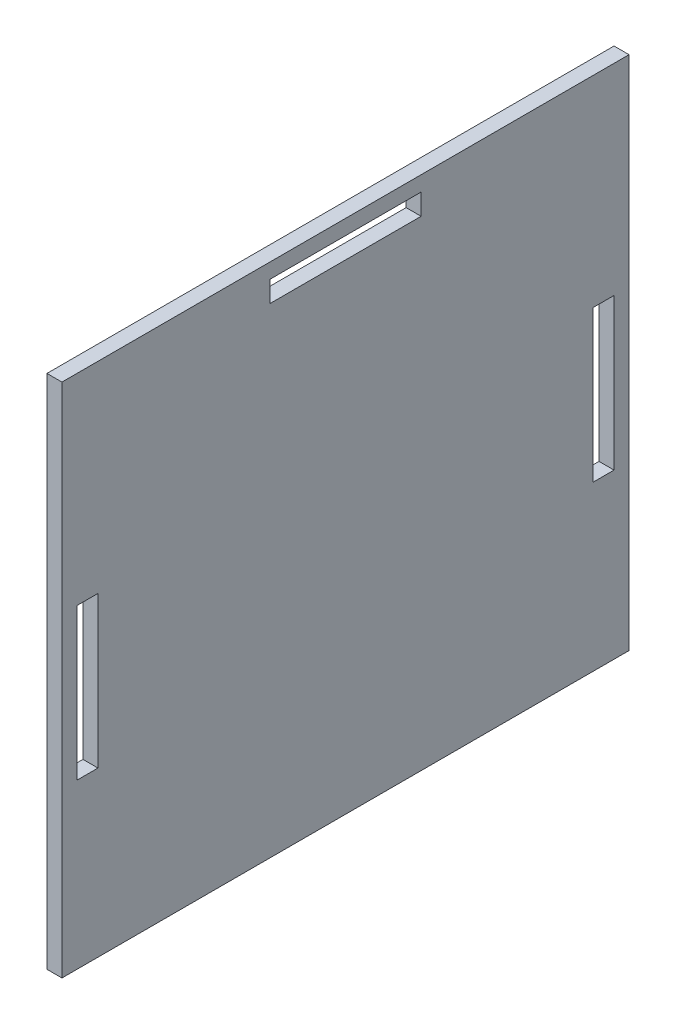
ISO-10303-21;
HEADER;
FILE_DESCRIPTION(('STEP AP214'),'2;1');
FILE_NAME('part.step','',(''),(''),'','','');
FILE_SCHEMA(('AUTOMOTIVE_DESIGN { 1 0 10303 214 1 1 1 1 }'));
ENDSEC;
DATA;
#1=APPLICATION_CONTEXT('core data for automotive mechanical design processes');
#2=APPLICATION_PROTOCOL_DEFINITION('international standard','automotive_design',2000,#1);
#3=PRODUCT_CONTEXT('',#1,'mechanical');
#4=PRODUCT('Part','Part','',(#3));
#5=PRODUCT_RELATED_PRODUCT_CATEGORY('part','',(#4));
#6=PRODUCT_DEFINITION_FORMATION('','',#4);
#7=PRODUCT_DEFINITION_CONTEXT('part definition',#1,'design');
#8=PRODUCT_DEFINITION('design','',#6,#7);
#9=PRODUCT_DEFINITION_SHAPE('','',#8);
#10=(LENGTH_UNIT() NAMED_UNIT(*) SI_UNIT(.MILLI.,.METRE.));
#11=(NAMED_UNIT(*) PLANE_ANGLE_UNIT() SI_UNIT($,.RADIAN.));
#12=(NAMED_UNIT(*) SI_UNIT($,.STERADIAN.) SOLID_ANGLE_UNIT());
#13=UNCERTAINTY_MEASURE_WITH_UNIT(LENGTH_MEASURE(1.E-05),#10,'distance_accuracy_value','');
#14=(GEOMETRIC_REPRESENTATION_CONTEXT(3) GLOBAL_UNCERTAINTY_ASSIGNED_CONTEXT((#13)) GLOBAL_UNIT_ASSIGNED_CONTEXT((#10,
#11,#12)) REPRESENTATION_CONTEXT('',''));
#15=CARTESIAN_POINT('',(0.,0.,0.));
#16=DIRECTION('',(0.,0.,1.));
#17=DIRECTION('',(1.,0.,0.));
#18=AXIS2_PLACEMENT_3D('',#15,#16,#17);
#19=CARTESIAN_POINT('',(5.,0.,0.));
#20=DIRECTION('',(-1.,0.,0.));
#21=DIRECTION('',(0.,0.,1.));
#22=AXIS2_PLACEMENT_3D('',#19,#20,#21);
#23=PLANE('',#22);
#24=DIRECTION('',(0.,1.,0.));
#25=VECTOR('',#24,1.);
#26=CARTESIAN_POINT('',(5.,54.6,12.));
#27=LINE('',#26,#25);
#28=CARTESIAN_POINT('',(5.,54.6,12.));
#29=VERTEX_POINT('',#28);
#30=CARTESIAN_POINT('',(5.,105.,12.));
#31=VERTEX_POINT('',#30);
#32=EDGE_CURVE('E241',#29,#31,#27,.T.);
#33=ORIENTED_EDGE('',*,*,#32,.T.);
#34=DIRECTION('',(0.,0.,-1.));
#35=VECTOR('',#34,1.);
#36=CARTESIAN_POINT('',(5.,105.,12.));
#37=LINE('',#36,#35);
#38=CARTESIAN_POINT('',(5.,105.,4.99999999999999));
#39=VERTEX_POINT('',#38);
#40=EDGE_CURVE('E235',#31,#39,#37,.T.);
#41=ORIENTED_EDGE('',*,*,#40,.T.);
#42=DIRECTION('',(0.,1.,0.));
#43=VECTOR('',#42,1.);
#44=CARTESIAN_POINT('',(5.,54.6,5.));
#45=LINE('',#44,#43);
#46=CARTESIAN_POINT('',(5.,54.6,5.));
#47=VERTEX_POINT('',#46);
#48=EDGE_CURVE('E226',#47,#39,#45,.T.);
#49=ORIENTED_EDGE('',*,*,#48,.F.);
#50=DIRECTION('',(0.,0.,-1.));
#51=VECTOR('',#50,1.);
#52=CARTESIAN_POINT('',(5.,54.6,12.));
#53=LINE('',#52,#51);
#54=EDGE_CURVE('E234',#29,#47,#53,.T.);
#55=ORIENTED_EDGE('',*,*,#54,.F.);
#56=EDGE_LOOP('',(#33,#41,#49,#55));
#57=FACE_BOUND('',#56,.T.);
#58=DIRECTION('',(0.,1.,0.));
#59=VECTOR('',#58,1.);
#60=CARTESIAN_POINT('',(5.,54.6,177.));
#61=LINE('',#60,#59);
#62=CARTESIAN_POINT('',(5.,54.6,177.));
#63=VERTEX_POINT('',#62);
#64=CARTESIAN_POINT('',(5.,105.,177.));
#65=VERTEX_POINT('',#64);
#66=EDGE_CURVE('E317',#63,#65,#61,.T.);
#67=ORIENTED_EDGE('',*,*,#66,.F.);
#68=DIRECTION('',(0.,0.,1.));
#69=VECTOR('',#68,1.);
#70=CARTESIAN_POINT('',(5.,54.6,177.));
#71=LINE('',#70,#69);
#72=CARTESIAN_POINT('',(5.,54.6,184.));
#73=VERTEX_POINT('',#72);
#74=EDGE_CURVE('E328',#63,#73,#71,.T.);
#75=ORIENTED_EDGE('',*,*,#74,.T.);
#76=DIRECTION('',(0.,1.,0.));
#77=VECTOR('',#76,1.);
#78=CARTESIAN_POINT('',(5.,54.6,184.));
#79=LINE('',#78,#77);
#80=CARTESIAN_POINT('',(5.,105.,184.));
#81=VERTEX_POINT('',#80);
#82=EDGE_CURVE('E324',#73,#81,#79,.T.);
#83=ORIENTED_EDGE('',*,*,#82,.T.);
#84=DIRECTION('',(0.,0.,1.));
#85=VECTOR('',#84,1.);
#86=CARTESIAN_POINT('',(5.,105.,177.));
#87=LINE('',#86,#85);
#88=EDGE_CURVE('E320',#65,#81,#87,.T.);
#89=ORIENTED_EDGE('',*,*,#88,.F.);
#90=EDGE_LOOP('',(#67,#75,#83,#89));
#91=FACE_BOUND('',#90,.T.);
#92=DIRECTION('',(0.,0.,1.));
#93=VECTOR('',#92,1.);
#94=CARTESIAN_POINT('',(5.,172.,0.));
#95=LINE('',#94,#93);
#96=CARTESIAN_POINT('',(5.,172.,0.));
#97=VERTEX_POINT('',#96);
#98=CARTESIAN_POINT('',(5.,172.,189.));
#99=VERTEX_POINT('',#98);
#100=EDGE_CURVE('E361',#97,#99,#95,.T.);
#101=ORIENTED_EDGE('',*,*,#100,.T.);
#102=DIRECTION('',(0.,1.,0.));
#103=VECTOR('',#102,1.);
#104=CARTESIAN_POINT('',(5.,0.,189.));
#105=LINE('',#104,#103);
#106=CARTESIAN_POINT('',(5.,0.,189.));
#107=VERTEX_POINT('',#106);
#108=EDGE_CURVE('E364',#107,#99,#105,.T.);
#109=ORIENTED_EDGE('',*,*,#108,.F.);
#110=DIRECTION('',(0.,0.,1.));
#111=VECTOR('',#110,1.);
#112=CARTESIAN_POINT('',(5.,0.,0.));
#113=LINE('',#112,#111);
#114=CARTESIAN_POINT('',(5.,0.,0.));
#115=VERTEX_POINT('',#114);
#116=EDGE_CURVE('E369',#115,#107,#113,.T.);
#117=ORIENTED_EDGE('',*,*,#116,.F.);
#118=DIRECTION('',(0.,1.,0.));
#119=VECTOR('',#118,1.);
#120=CARTESIAN_POINT('',(5.,0.,0.));
#121=LINE('',#120,#119);
#122=EDGE_CURVE('E373',#115,#97,#121,.T.);
#123=ORIENTED_EDGE('',*,*,#122,.T.);
#124=EDGE_LOOP('',(#101,#109,#117,#123));
#125=FACE_BOUND('',#124,.T.);
#126=DIRECTION('',(0.,0.,-1.));
#127=VECTOR('',#126,1.);
#128=CARTESIAN_POINT('',(5.,160.,119.7));
#129=LINE('',#128,#127);
#130=CARTESIAN_POINT('',(5.,160.,119.7));
#131=VERTEX_POINT('',#130);
#132=CARTESIAN_POINT('',(5.,160.,69.3));
#133=VERTEX_POINT('',#132);
#134=EDGE_CURVE('E274',#131,#133,#129,.T.);
#135=ORIENTED_EDGE('',*,*,#134,.F.);
#136=DIRECTION('',(0.,-1.,0.));
#137=VECTOR('',#136,1.);
#138=CARTESIAN_POINT('',(5.,167.,119.7));
#139=LINE('',#138,#137);
#140=CARTESIAN_POINT('',(5.,167.,119.7));
#141=VERTEX_POINT('',#140);
#142=EDGE_CURVE('E286',#141,#131,#139,.T.);
#143=ORIENTED_EDGE('',*,*,#142,.F.);
#144=DIRECTION('',(0.,0.,-1.));
#145=VECTOR('',#144,1.);
#146=CARTESIAN_POINT('',(5.,167.,119.7));
#147=LINE('',#146,#145);
#148=CARTESIAN_POINT('',(5.,167.,69.3));
#149=VERTEX_POINT('',#148);
#150=EDGE_CURVE('E282',#141,#149,#147,.T.);
#151=ORIENTED_EDGE('',*,*,#150,.T.);
#152=DIRECTION('',(0.,-1.,0.));
#153=VECTOR('',#152,1.);
#154=CARTESIAN_POINT('',(5.,167.,69.3));
#155=LINE('',#154,#153);
#156=EDGE_CURVE('E277',#149,#133,#155,.T.);
#157=ORIENTED_EDGE('',*,*,#156,.T.);
#158=EDGE_LOOP('',(#135,#143,#151,#157));
#159=FACE_BOUND('',#158,.T.);
#160=ADVANCED_FACE('F114',(#57,#91,#125,#159),#23,.F.);
#161=CARTESIAN_POINT('',(0.,0.,0.));
#162=DIRECTION('',(-1.,0.,0.));
#163=DIRECTION('',(0.,0.,1.));
#164=AXIS2_PLACEMENT_3D('',#161,#162,#163);
#165=PLANE('',#164);
#166=DIRECTION('',(0.,0.,-1.));
#167=VECTOR('',#166,1.);
#168=CARTESIAN_POINT('',(0.,105.,12.));
#169=LINE('',#168,#167);
#170=CARTESIAN_POINT('',(0.,105.,12.));
#171=VERTEX_POINT('',#170);
#172=CARTESIAN_POINT('',(0.,105.,4.99999999999999));
#173=VERTEX_POINT('',#172);
#174=EDGE_CURVE('E138',#171,#173,#169,.T.);
#175=ORIENTED_EDGE('',*,*,#174,.F.);
#176=DIRECTION('',(0.,1.,0.));
#177=VECTOR('',#176,1.);
#178=CARTESIAN_POINT('',(0.,54.6,12.));
#179=LINE('',#178,#177);
#180=CARTESIAN_POINT('',(0.,54.6,12.));
#181=VERTEX_POINT('',#180);
#182=EDGE_CURVE('E246',#181,#171,#179,.T.);
#183=ORIENTED_EDGE('',*,*,#182,.F.);
#184=DIRECTION('',(0.,0.,-1.));
#185=VECTOR('',#184,1.);
#186=CARTESIAN_POINT('',(0.,54.6,12.));
#187=LINE('',#186,#185);
#188=CARTESIAN_POINT('',(0.,54.6,5.));
#189=VERTEX_POINT('',#188);
#190=EDGE_CURVE('E250',#181,#189,#187,.T.);
#191=ORIENTED_EDGE('',*,*,#190,.T.);
#192=DIRECTION('',(0.,1.,0.));
#193=VECTOR('',#192,1.);
#194=CARTESIAN_POINT('',(0.,54.6,5.));
#195=LINE('',#194,#193);
#196=EDGE_CURVE('E259',#189,#173,#195,.T.);
#197=ORIENTED_EDGE('',*,*,#196,.T.);
#198=EDGE_LOOP('',(#175,#183,#191,#197));
#199=FACE_BOUND('',#198,.T.);
#200=DIRECTION('',(0.,0.,1.));
#201=VECTOR('',#200,1.);
#202=CARTESIAN_POINT('',(0.,172.,0.));
#203=LINE('',#202,#201);
#204=CARTESIAN_POINT('',(0.,172.,0.));
#205=VERTEX_POINT('',#204);
#206=CARTESIAN_POINT('',(0.,172.,189.));
#207=VERTEX_POINT('',#206);
#208=EDGE_CURVE('E360',#205,#207,#203,.T.);
#209=ORIENTED_EDGE('',*,*,#208,.F.);
#210=DIRECTION('',(0.,1.,0.));
#211=VECTOR('',#210,1.);
#212=CARTESIAN_POINT('',(0.,0.,0.));
#213=LINE('',#212,#211);
#214=CARTESIAN_POINT('',(0.,0.,0.));
#215=VERTEX_POINT('',#214);
#216=EDGE_CURVE('E365',#215,#205,#213,.T.);
#217=ORIENTED_EDGE('',*,*,#216,.F.);
#218=DIRECTION('',(0.,0.,1.));
#219=VECTOR('',#218,1.);
#220=CARTESIAN_POINT('',(0.,0.,0.));
#221=LINE('',#220,#219);
#222=CARTESIAN_POINT('',(0.,0.,189.));
#223=VERTEX_POINT('',#222);
#224=EDGE_CURVE('E384',#215,#223,#221,.T.);
#225=ORIENTED_EDGE('',*,*,#224,.T.);
#226=DIRECTION('',(0.,1.,0.));
#227=VECTOR('',#226,1.);
#228=CARTESIAN_POINT('',(0.,0.,189.));
#229=LINE('',#228,#227);
#230=EDGE_CURVE('E380',#223,#207,#229,.T.);
#231=ORIENTED_EDGE('',*,*,#230,.T.);
#232=EDGE_LOOP('',(#209,#217,#225,#231));
#233=FACE_BOUND('',#232,.T.);
#234=DIRECTION('',(0.,0.,1.));
#235=VECTOR('',#234,1.);
#236=CARTESIAN_POINT('',(0.,54.6,177.));
#237=LINE('',#236,#235);
#238=CARTESIAN_POINT('',(0.,54.6,177.));
#239=VERTEX_POINT('',#238);
#240=CARTESIAN_POINT('',(0.,54.6,184.));
#241=VERTEX_POINT('',#240);
#242=EDGE_CURVE('E321',#239,#241,#237,.T.);
#243=ORIENTED_EDGE('',*,*,#242,.F.);
#244=DIRECTION('',(0.,1.,0.));
#245=VECTOR('',#244,1.);
#246=CARTESIAN_POINT('',(0.,54.6,177.));
#247=LINE('',#246,#245);
#248=CARTESIAN_POINT('',(0.,105.,177.));
#249=VERTEX_POINT('',#248);
#250=EDGE_CURVE('E316',#239,#249,#247,.T.);
#251=ORIENTED_EDGE('',*,*,#250,.T.);
#252=DIRECTION('',(0.,0.,1.));
#253=VECTOR('',#252,1.);
#254=CARTESIAN_POINT('',(0.,105.,177.));
#255=LINE('',#254,#253);
#256=CARTESIAN_POINT('',(0.,105.,184.));
#257=VERTEX_POINT('',#256);
#258=EDGE_CURVE('E336',#249,#257,#255,.T.);
#259=ORIENTED_EDGE('',*,*,#258,.T.);
#260=DIRECTION('',(0.,1.,0.));
#261=VECTOR('',#260,1.);
#262=CARTESIAN_POINT('',(0.,54.6,184.));
#263=LINE('',#262,#261);
#264=EDGE_CURVE('E340',#241,#257,#263,.T.);
#265=ORIENTED_EDGE('',*,*,#264,.F.);
#266=EDGE_LOOP('',(#243,#251,#259,#265));
#267=FACE_BOUND('',#266,.T.);
#268=DIRECTION('',(0.,-1.,0.));
#269=VECTOR('',#268,1.);
#270=CARTESIAN_POINT('',(0.,167.,119.7));
#271=LINE('',#270,#269);
#272=CARTESIAN_POINT('',(0.,167.,119.7));
#273=VERTEX_POINT('',#272);
#274=CARTESIAN_POINT('',(0.,160.,119.7));
#275=VERTEX_POINT('',#274);
#276=EDGE_CURVE('E278',#273,#275,#271,.T.);
#277=ORIENTED_EDGE('',*,*,#276,.T.);
#278=DIRECTION('',(0.,0.,-1.));
#279=VECTOR('',#278,1.);
#280=CARTESIAN_POINT('',(0.,160.,119.7));
#281=LINE('',#280,#279);
#282=CARTESIAN_POINT('',(0.,160.,69.3));
#283=VERTEX_POINT('',#282);
#284=EDGE_CURVE('E268',#275,#283,#281,.T.);
#285=ORIENTED_EDGE('',*,*,#284,.T.);
#286=DIRECTION('',(0.,-1.,0.));
#287=VECTOR('',#286,1.);
#288=CARTESIAN_POINT('',(0.,167.,69.3));
#289=LINE('',#288,#287);
#290=CARTESIAN_POINT('',(0.,167.,69.3));
#291=VERTEX_POINT('',#290);
#292=EDGE_CURVE('E293',#291,#283,#289,.T.);
#293=ORIENTED_EDGE('',*,*,#292,.F.);
#294=DIRECTION('',(0.,0.,-1.));
#295=VECTOR('',#294,1.);
#296=CARTESIAN_POINT('',(0.,167.,119.7));
#297=LINE('',#296,#295);
#298=EDGE_CURVE('E297',#273,#291,#297,.T.);
#299=ORIENTED_EDGE('',*,*,#298,.F.);
#300=EDGE_LOOP('',(#277,#285,#293,#299));
#301=FACE_BOUND('',#300,.T.);
#302=ADVANCED_FACE('F408',(#199,#233,#267,#301),#165,.T.);
#303=CARTESIAN_POINT('',(5.,172.,0.));
#304=DIRECTION('',(0.,-1.,0.));
#305=DIRECTION('',(0.,0.,-1.));
#306=AXIS2_PLACEMENT_3D('',#303,#304,#305);
#307=PLANE('',#306);
#308=ORIENTED_EDGE('',*,*,#208,.T.);
#309=DIRECTION('',(-1.,0.,0.));
#310=VECTOR('',#309,1.);
#311=CARTESIAN_POINT('',(5.,172.,189.));
#312=LINE('',#311,#310);
#313=EDGE_CURVE('E12',#99,#207,#312,.T.);
#314=ORIENTED_EDGE('',*,*,#313,.F.);
#315=ORIENTED_EDGE('',*,*,#100,.F.);
#316=DIRECTION('',(-1.,0.,0.));
#317=VECTOR('',#316,1.);
#318=CARTESIAN_POINT('',(5.,172.,0.));
#319=LINE('',#318,#317);
#320=EDGE_CURVE('E376',#97,#205,#319,.T.);
#321=ORIENTED_EDGE('',*,*,#320,.T.);
#322=EDGE_LOOP('',(#308,#314,#315,#321));
#323=FACE_BOUND('',#322,.T.);
#324=ADVANCED_FACE('F116',(#323),#307,.F.);
#325=CARTESIAN_POINT('',(5.,0.,189.));
#326=DIRECTION('',(0.,0.,1.));
#327=DIRECTION('',(1.,0.,0.));
#328=AXIS2_PLACEMENT_3D('',#325,#326,#327);
#329=PLANE('',#328);
#330=ORIENTED_EDGE('',*,*,#230,.F.);
#331=DIRECTION('',(-1.,0.,0.));
#332=VECTOR('',#331,1.);
#333=CARTESIAN_POINT('',(5.,0.,189.));
#334=LINE('',#333,#332);
#335=EDGE_CURVE('E123',#107,#223,#334,.T.);
#336=ORIENTED_EDGE('',*,*,#335,.F.);
#337=ORIENTED_EDGE('',*,*,#108,.T.);
#338=ORIENTED_EDGE('',*,*,#313,.T.);
#339=EDGE_LOOP('',(#330,#336,#337,#338));
#340=FACE_BOUND('',#339,.T.);
#341=ADVANCED_FACE('F403',(#340),#329,.T.);
#342=CARTESIAN_POINT('',(5.,0.,0.));
#343=DIRECTION('',(0.,-1.,0.));
#344=DIRECTION('',(0.,0.,-1.));
#345=AXIS2_PLACEMENT_3D('',#342,#343,#344);
#346=PLANE('',#345);
#347=ORIENTED_EDGE('',*,*,#224,.F.);
#348=DIRECTION('',(-1.,0.,0.));
#349=VECTOR('',#348,1.);
#350=CARTESIAN_POINT('',(5.,0.,0.));
#351=LINE('',#350,#349);
#352=EDGE_CURVE('E393',#115,#215,#351,.T.);
#353=ORIENTED_EDGE('',*,*,#352,.F.);
#354=ORIENTED_EDGE('',*,*,#116,.T.);
#355=ORIENTED_EDGE('',*,*,#335,.T.);
#356=EDGE_LOOP('',(#347,#353,#354,#355));
#357=FACE_BOUND('',#356,.T.);
#358=ADVANCED_FACE('F399',(#357),#346,.T.);
#359=CARTESIAN_POINT('',(5.,0.,0.));
#360=DIRECTION('',(0.,0.,1.));
#361=DIRECTION('',(0.,-1.,0.));
#362=AXIS2_PLACEMENT_3D('',#359,#360,#361);
#363=PLANE('',#362);
#364=ORIENTED_EDGE('',*,*,#216,.T.);
#365=ORIENTED_EDGE('',*,*,#320,.F.);
#366=ORIENTED_EDGE('',*,*,#122,.F.);
#367=ORIENTED_EDGE('',*,*,#352,.T.);
#368=EDGE_LOOP('',(#364,#365,#366,#367));
#369=FACE_BOUND('',#368,.T.);
#370=ADVANCED_FACE('F412',(#369),#363,.F.);
#371=CARTESIAN_POINT('',(5.,54.6,177.));
#372=DIRECTION('',(0.,0.,1.));
#373=DIRECTION('',(1.,0.,0.));
#374=AXIS2_PLACEMENT_3D('',#371,#372,#373);
#375=PLANE('',#374);
#376=ORIENTED_EDGE('',*,*,#250,.F.);
#377=DIRECTION('',(-1.,0.,0.));
#378=VECTOR('',#377,1.);
#379=CARTESIAN_POINT('',(5.,54.6,177.));
#380=LINE('',#379,#378);
#381=EDGE_CURVE('E332',#63,#239,#380,.T.);
#382=ORIENTED_EDGE('',*,*,#381,.F.);
#383=ORIENTED_EDGE('',*,*,#66,.T.);
#384=DIRECTION('',(-1.,0.,0.));
#385=VECTOR('',#384,1.);
#386=CARTESIAN_POINT('',(5.,105.,177.));
#387=LINE('',#386,#385);
#388=EDGE_CURVE('E356',#65,#249,#387,.T.);
#389=ORIENTED_EDGE('',*,*,#388,.T.);
#390=EDGE_LOOP('',(#376,#382,#383,#389));
#391=FACE_BOUND('',#390,.T.);
#392=ADVANCED_FACE('F461',(#391),#375,.T.);
#393=CARTESIAN_POINT('',(5.,105.,177.));
#394=DIRECTION('',(0.,-1.,0.));
#395=DIRECTION('',(0.,0.,-1.));
#396=AXIS2_PLACEMENT_3D('',#393,#394,#395);
#397=PLANE('',#396);
#398=ORIENTED_EDGE('',*,*,#258,.F.);
#399=ORIENTED_EDGE('',*,*,#388,.F.);
#400=ORIENTED_EDGE('',*,*,#88,.T.);
#401=DIRECTION('',(-1.,0.,0.));
#402=VECTOR('',#401,1.);
#403=CARTESIAN_POINT('',(5.,105.,184.));
#404=LINE('',#403,#402);
#405=EDGE_CURVE('E353',#81,#257,#404,.T.);
#406=ORIENTED_EDGE('',*,*,#405,.T.);
#407=EDGE_LOOP('',(#398,#399,#400,#406));
#408=FACE_BOUND('',#407,.T.);
#409=ADVANCED_FACE('F457',(#408),#397,.T.);
#410=CARTESIAN_POINT('',(5.,54.6,184.));
#411=DIRECTION('',(0.,0.,1.));
#412=DIRECTION('',(1.,0.,0.));
#413=AXIS2_PLACEMENT_3D('',#410,#411,#412);
#414=PLANE('',#413);
#415=ORIENTED_EDGE('',*,*,#264,.T.);
#416=ORIENTED_EDGE('',*,*,#405,.F.);
#417=ORIENTED_EDGE('',*,*,#82,.F.);
#418=DIRECTION('',(-1.,0.,0.));
#419=VECTOR('',#418,1.);
#420=CARTESIAN_POINT('',(5.,54.6,184.));
#421=LINE('',#420,#419);
#422=EDGE_CURVE('E350',#73,#241,#421,.T.);
#423=ORIENTED_EDGE('',*,*,#422,.T.);
#424=EDGE_LOOP('',(#415,#416,#417,#423));
#425=FACE_BOUND('',#424,.T.);
#426=ADVANCED_FACE('F453',(#425),#414,.F.);
#427=CARTESIAN_POINT('',(5.,54.6,177.));
#428=DIRECTION('',(0.,-1.,0.));
#429=DIRECTION('',(0.,0.,-1.));
#430=AXIS2_PLACEMENT_3D('',#427,#428,#429);
#431=PLANE('',#430);
#432=ORIENTED_EDGE('',*,*,#242,.T.);
#433=ORIENTED_EDGE('',*,*,#422,.F.);
#434=ORIENTED_EDGE('',*,*,#74,.F.);
#435=ORIENTED_EDGE('',*,*,#381,.T.);
#436=EDGE_LOOP('',(#432,#433,#434,#435));
#437=FACE_BOUND('',#436,.T.);
#438=ADVANCED_FACE('F450',(#437),#431,.F.);
#439=CARTESIAN_POINT('',(5.,160.,119.7));
#440=DIRECTION('',(0.,1.,0.));
#441=DIRECTION('',(0.,0.,1.));
#442=AXIS2_PLACEMENT_3D('',#439,#440,#441);
#443=PLANE('',#442);
#444=ORIENTED_EDGE('',*,*,#284,.F.);
#445=DIRECTION('',(-1.,0.,0.));
#446=VECTOR('',#445,1.);
#447=CARTESIAN_POINT('',(5.,160.,119.7));
#448=LINE('',#447,#446);
#449=EDGE_CURVE('E289',#131,#275,#448,.T.);
#450=ORIENTED_EDGE('',*,*,#449,.F.);
#451=ORIENTED_EDGE('',*,*,#134,.T.);
#452=DIRECTION('',(-1.,0.,0.));
#453=VECTOR('',#452,1.);
#454=CARTESIAN_POINT('',(5.,160.,69.3));
#455=LINE('',#454,#453);
#456=EDGE_CURVE('E313',#133,#283,#455,.T.);
#457=ORIENTED_EDGE('',*,*,#456,.T.);
#458=EDGE_LOOP('',(#444,#450,#451,#457));
#459=FACE_BOUND('',#458,.T.);
#460=ADVANCED_FACE('F426',(#459),#443,.T.);
#461=CARTESIAN_POINT('',(5.,167.,69.3));
#462=DIRECTION('',(0.,0.,-1.));
#463=DIRECTION('',(-1.,0.,0.));
#464=AXIS2_PLACEMENT_3D('',#461,#462,#463);
#465=PLANE('',#464);
#466=ORIENTED_EDGE('',*,*,#292,.T.);
#467=ORIENTED_EDGE('',*,*,#456,.F.);
#468=ORIENTED_EDGE('',*,*,#156,.F.);
#469=DIRECTION('',(-1.,0.,0.));
#470=VECTOR('',#469,1.);
#471=CARTESIAN_POINT('',(5.,167.,69.3));
#472=LINE('',#471,#470);
#473=EDGE_CURVE('E310',#149,#291,#472,.T.);
#474=ORIENTED_EDGE('',*,*,#473,.T.);
#475=EDGE_LOOP('',(#466,#467,#468,#474));
#476=FACE_BOUND('',#475,.T.);
#477=ADVANCED_FACE('F428',(#476),#465,.F.);
#478=CARTESIAN_POINT('',(5.,167.,119.7));
#479=DIRECTION('',(0.,1.,0.));
#480=DIRECTION('',(0.,0.,1.));
#481=AXIS2_PLACEMENT_3D('',#478,#479,#480);
#482=PLANE('',#481);
#483=ORIENTED_EDGE('',*,*,#298,.T.);
#484=ORIENTED_EDGE('',*,*,#473,.F.);
#485=ORIENTED_EDGE('',*,*,#150,.F.);
#486=DIRECTION('',(-1.,0.,0.));
#487=VECTOR('',#486,1.);
#488=CARTESIAN_POINT('',(5.,167.,119.7));
#489=LINE('',#488,#487);
#490=EDGE_CURVE('E307',#141,#273,#489,.T.);
#491=ORIENTED_EDGE('',*,*,#490,.T.);
#492=EDGE_LOOP('',(#483,#484,#485,#491));
#493=FACE_BOUND('',#492,.T.);
#494=ADVANCED_FACE('F437',(#493),#482,.F.);
#495=CARTESIAN_POINT('',(5.,167.,119.7));
#496=DIRECTION('',(0.,0.,-1.));
#497=DIRECTION('',(-1.,0.,0.));
#498=AXIS2_PLACEMENT_3D('',#495,#496,#497);
#499=PLANE('',#498);
#500=ORIENTED_EDGE('',*,*,#276,.F.);
#501=ORIENTED_EDGE('',*,*,#490,.F.);
#502=ORIENTED_EDGE('',*,*,#142,.T.);
#503=ORIENTED_EDGE('',*,*,#449,.T.);
#504=EDGE_LOOP('',(#500,#501,#502,#503));
#505=FACE_BOUND('',#504,.T.);
#506=ADVANCED_FACE('F434',(#505),#499,.T.);
#507=CARTESIAN_POINT('',(5.,105.,12.));
#508=DIRECTION('',(0.,1.,0.));
#509=DIRECTION('',(0.,0.,1.));
#510=AXIS2_PLACEMENT_3D('',#507,#508,#509);
#511=PLANE('',#510);
#512=ORIENTED_EDGE('',*,*,#174,.T.);
#513=DIRECTION('',(-1.,0.,0.));
#514=VECTOR('',#513,1.);
#515=CARTESIAN_POINT('',(5.,105.,4.99999999999999));
#516=LINE('',#515,#514);
#517=EDGE_CURVE('E228',#39,#173,#516,.T.);
#518=ORIENTED_EDGE('',*,*,#517,.F.);
#519=ORIENTED_EDGE('',*,*,#40,.F.);
#520=DIRECTION('',(-1.,0.,0.));
#521=VECTOR('',#520,1.);
#522=CARTESIAN_POINT('',(5.,105.,12.));
#523=LINE('',#522,#521);
#524=EDGE_CURVE('E265',#31,#171,#523,.T.);
#525=ORIENTED_EDGE('',*,*,#524,.T.);
#526=EDGE_LOOP('',(#512,#518,#519,#525));
#527=FACE_BOUND('',#526,.T.);
#528=ADVANCED_FACE('F238',(#527),#511,.F.);
#529=CARTESIAN_POINT('',(5.,54.6,12.));
#530=DIRECTION('',(0.,0.,1.));
#531=DIRECTION('',(1.,0.,0.));
#532=AXIS2_PLACEMENT_3D('',#529,#530,#531);
#533=PLANE('',#532);
#534=ORIENTED_EDGE('',*,*,#182,.T.);
#535=ORIENTED_EDGE('',*,*,#524,.F.);
#536=ORIENTED_EDGE('',*,*,#32,.F.);
#537=DIRECTION('',(-1.,0.,0.));
#538=VECTOR('',#537,1.);
#539=CARTESIAN_POINT('',(5.,54.6,12.));
#540=LINE('',#539,#538);
#541=EDGE_CURVE('E269',#29,#181,#540,.T.);
#542=ORIENTED_EDGE('',*,*,#541,.T.);
#543=EDGE_LOOP('',(#534,#535,#536,#542));
#544=FACE_BOUND('',#543,.T.);
#545=ADVANCED_FACE('F582',(#544),#533,.F.);
#546=CARTESIAN_POINT('',(5.,54.6,12.));
#547=DIRECTION('',(0.,1.,0.));
#548=DIRECTION('',(0.,0.,1.));
#549=AXIS2_PLACEMENT_3D('',#546,#547,#548);
#550=PLANE('',#549);
#551=ORIENTED_EDGE('',*,*,#190,.F.);
#552=ORIENTED_EDGE('',*,*,#541,.F.);
#553=ORIENTED_EDGE('',*,*,#54,.T.);
#554=DIRECTION('',(-1.,0.,0.));
#555=VECTOR('',#554,1.);
#556=CARTESIAN_POINT('',(5.,54.6,5.));
#557=LINE('',#556,#555);
#558=EDGE_CURVE('E130',#47,#189,#557,.T.);
#559=ORIENTED_EDGE('',*,*,#558,.T.);
#560=EDGE_LOOP('',(#551,#552,#553,#559));
#561=FACE_BOUND('',#560,.T.);
#562=ADVANCED_FACE('F591',(#561),#550,.T.);
#563=CARTESIAN_POINT('',(5.,54.6,5.));
#564=DIRECTION('',(0.,0.,1.));
#565=DIRECTION('',(0.,-1.,0.));
#566=AXIS2_PLACEMENT_3D('',#563,#564,#565);
#567=PLANE('',#566);
#568=ORIENTED_EDGE('',*,*,#196,.F.);
#569=ORIENTED_EDGE('',*,*,#558,.F.);
#570=ORIENTED_EDGE('',*,*,#48,.T.);
#571=ORIENTED_EDGE('',*,*,#517,.T.);
#572=EDGE_LOOP('',(#568,#569,#570,#571));
#573=FACE_BOUND('',#572,.T.);
#574=ADVANCED_FACE('F227',(#573),#567,.T.);
#575=CLOSED_SHELL('',(#160,#302,#324,#341,#358,#370,#392,#409,#426,#438,#460,#477,#494,#506,
#528,#545,#562,#574));
#576=MANIFOLD_SOLID_BREP('B2',#575);
#577=ADVANCED_BREP_SHAPE_REPRESENTATION('',(#18,#576),#14);
#578=SHAPE_DEFINITION_REPRESENTATION(#9,#577);
ENDSEC;
END-ISO-10303-21;
